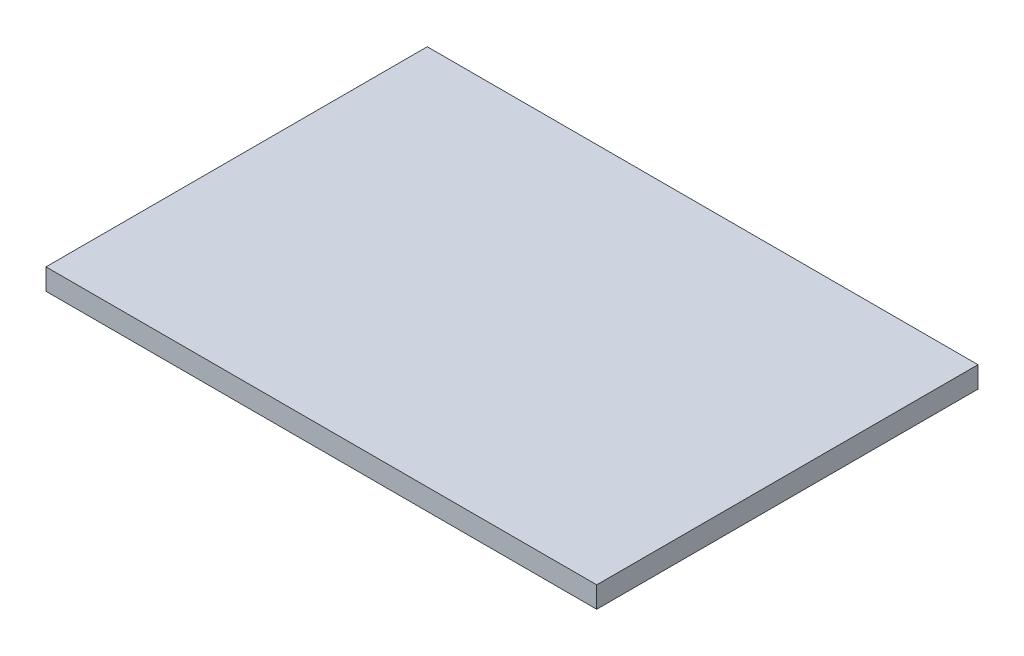
ISO-10303-21;
HEADER;
FILE_DESCRIPTION(('STEP AP214'),'2;1');
FILE_NAME('part.step','',(''),(''),'','','');
FILE_SCHEMA(('AUTOMOTIVE_DESIGN { 1 0 10303 214 1 1 1 1 }'));
ENDSEC;
DATA;
#1=APPLICATION_CONTEXT('core data for automotive mechanical design processes');
#2=APPLICATION_PROTOCOL_DEFINITION('international standard','automotive_design',2000,#1);
#3=PRODUCT_CONTEXT('',#1,'mechanical');
#4=PRODUCT('Part','Part','',(#3));
#5=PRODUCT_RELATED_PRODUCT_CATEGORY('part','',(#4));
#6=PRODUCT_DEFINITION_FORMATION('','',#4);
#7=PRODUCT_DEFINITION_CONTEXT('part definition',#1,'design');
#8=PRODUCT_DEFINITION('design','',#6,#7);
#9=PRODUCT_DEFINITION_SHAPE('','',#8);
#10=(LENGTH_UNIT() NAMED_UNIT(*) SI_UNIT(.MILLI.,.METRE.));
#11=(NAMED_UNIT(*) PLANE_ANGLE_UNIT() SI_UNIT($,.RADIAN.));
#12=(NAMED_UNIT(*) SI_UNIT($,.STERADIAN.) SOLID_ANGLE_UNIT());
#13=UNCERTAINTY_MEASURE_WITH_UNIT(LENGTH_MEASURE(1.E-05),#10,'distance_accuracy_value','');
#14=(GEOMETRIC_REPRESENTATION_CONTEXT(3) GLOBAL_UNCERTAINTY_ASSIGNED_CONTEXT((#13)) GLOBAL_UNIT_ASSIGNED_CONTEXT((#10,
#11,#12)) REPRESENTATION_CONTEXT('',''));
#15=CARTESIAN_POINT('',(0.,0.,0.));
#16=DIRECTION('',(0.,0.,1.));
#17=DIRECTION('',(1.,0.,0.));
#18=AXIS2_PLACEMENT_3D('',#15,#16,#17);
#19=CARTESIAN_POINT('',(13.,1.,9.));
#20=DIRECTION('',(-1.,0.,0.));
#21=DIRECTION('',(0.,0.,1.));
#22=AXIS2_PLACEMENT_3D('',#19,#20,#21);
#23=PLANE('',#22);
#24=DIRECTION('',(0.,0.,-1.));
#25=VECTOR('',#24,1.);
#26=CARTESIAN_POINT('',(13.,0.,9.));
#27=LINE('',#26,#25);
#28=CARTESIAN_POINT('',(13.,0.,9.));
#29=VERTEX_POINT('',#28);
#30=CARTESIAN_POINT('',(13.,0.,-9.));
#31=VERTEX_POINT('',#30);
#32=EDGE_CURVE('E107',#29,#31,#27,.T.);
#33=ORIENTED_EDGE('',*,*,#32,.T.);
#34=DIRECTION('',(0.,-1.,0.));
#35=VECTOR('',#34,1.);
#36=CARTESIAN_POINT('',(13.,1.,-9.));
#37=LINE('',#36,#35);
#38=CARTESIAN_POINT('',(13.,1.,-9.));
#39=VERTEX_POINT('',#38);
#40=EDGE_CURVE('E11',#39,#31,#37,.T.);
#41=ORIENTED_EDGE('',*,*,#40,.F.);
#42=DIRECTION('',(0.,0.,-1.));
#43=VECTOR('',#42,1.);
#44=CARTESIAN_POINT('',(13.,1.,9.));
#45=LINE('',#44,#43);
#46=CARTESIAN_POINT('',(13.,1.,9.));
#47=VERTEX_POINT('',#46);
#48=EDGE_CURVE('E91',#47,#39,#45,.T.);
#49=ORIENTED_EDGE('',*,*,#48,.F.);
#50=DIRECTION('',(0.,-1.,0.));
#51=VECTOR('',#50,1.);
#52=CARTESIAN_POINT('',(13.,1.,9.));
#53=LINE('',#52,#51);
#54=EDGE_CURVE('E103',#47,#29,#53,.T.);
#55=ORIENTED_EDGE('',*,*,#54,.T.);
#56=EDGE_LOOP('',(#33,#41,#49,#55));
#57=FACE_BOUND('',#56,.T.);
#58=ADVANCED_FACE('F39',(#57),#23,.F.);
#59=CARTESIAN_POINT('',(-13.,1.,-9.));
#60=DIRECTION('',(0.,0.,1.));
#61=DIRECTION('',(1.,0.,0.));
#62=AXIS2_PLACEMENT_3D('',#59,#60,#61);
#63=PLANE('',#62);
#64=DIRECTION('',(-1.,0.,0.));
#65=VECTOR('',#64,1.);
#66=CARTESIAN_POINT('',(-13.,0.,-9.));
#67=LINE('',#66,#65);
#68=CARTESIAN_POINT('',(-13.,0.,-9.));
#69=VERTEX_POINT('',#68);
#70=EDGE_CURVE('E96',#31,#69,#67,.T.);
#71=ORIENTED_EDGE('',*,*,#70,.T.);
#72=DIRECTION('',(0.,-1.,0.));
#73=VECTOR('',#72,1.);
#74=CARTESIAN_POINT('',(-13.,1.,-9.));
#75=LINE('',#74,#73);
#76=CARTESIAN_POINT('',(-13.,1.,-9.));
#77=VERTEX_POINT('',#76);
#78=EDGE_CURVE('E48',#77,#69,#75,.T.);
#79=ORIENTED_EDGE('',*,*,#78,.F.);
#80=DIRECTION('',(-1.,0.,0.));
#81=VECTOR('',#80,1.);
#82=CARTESIAN_POINT('',(-13.,1.,-9.));
#83=LINE('',#82,#81);
#84=EDGE_CURVE('E86',#39,#77,#83,.T.);
#85=ORIENTED_EDGE('',*,*,#84,.F.);
#86=ORIENTED_EDGE('',*,*,#40,.T.);
#87=EDGE_LOOP('',(#71,#79,#85,#86));
#88=FACE_BOUND('',#87,.T.);
#89=ADVANCED_FACE('F95',(#88),#63,.F.);
#90=CARTESIAN_POINT('',(-13.,1.,9.));
#91=DIRECTION('',(1.,0.,0.));
#92=DIRECTION('',(0.,0.,-1.));
#93=AXIS2_PLACEMENT_3D('',#90,#91,#92);
#94=PLANE('',#93);
#95=DIRECTION('',(0.,0.,1.));
#96=VECTOR('',#95,1.);
#97=CARTESIAN_POINT('',(-13.,0.,9.));
#98=LINE('',#97,#96);
#99=CARTESIAN_POINT('',(-13.,0.,9.));
#100=VERTEX_POINT('',#99);
#101=EDGE_CURVE('E73',#69,#100,#98,.T.);
#102=ORIENTED_EDGE('',*,*,#101,.T.);
#103=DIRECTION('',(0.,-1.,0.));
#104=VECTOR('',#103,1.);
#105=CARTESIAN_POINT('',(-13.,1.,9.));
#106=LINE('',#105,#104);
#107=CARTESIAN_POINT('',(-13.,1.,9.));
#108=VERTEX_POINT('',#107);
#109=EDGE_CURVE('E98',#108,#100,#106,.T.);
#110=ORIENTED_EDGE('',*,*,#109,.F.);
#111=DIRECTION('',(0.,0.,1.));
#112=VECTOR('',#111,1.);
#113=CARTESIAN_POINT('',(-13.,1.,9.));
#114=LINE('',#113,#112);
#115=EDGE_CURVE('E89',#77,#108,#114,.T.);
#116=ORIENTED_EDGE('',*,*,#115,.F.);
#117=ORIENTED_EDGE('',*,*,#78,.T.);
#118=EDGE_LOOP('',(#102,#110,#116,#117));
#119=FACE_BOUND('',#118,.T.);
#120=ADVANCED_FACE('F99',(#119),#94,.F.);
#121=CARTESIAN_POINT('',(-13.,1.,9.));
#122=DIRECTION('',(0.,0.,-1.));
#123=DIRECTION('',(-1.,0.,0.));
#124=AXIS2_PLACEMENT_3D('',#121,#122,#123);
#125=PLANE('',#124);
#126=DIRECTION('',(1.,0.,0.));
#127=VECTOR('',#126,1.);
#128=CARTESIAN_POINT('',(-13.,0.,9.));
#129=LINE('',#128,#127);
#130=EDGE_CURVE('E79',#100,#29,#129,.T.);
#131=ORIENTED_EDGE('',*,*,#130,.T.);
#132=ORIENTED_EDGE('',*,*,#54,.F.);
#133=DIRECTION('',(1.,0.,0.));
#134=VECTOR('',#133,1.);
#135=CARTESIAN_POINT('',(-13.,1.,9.));
#136=LINE('',#135,#134);
#137=EDGE_CURVE('E56',#108,#47,#136,.T.);
#138=ORIENTED_EDGE('',*,*,#137,.F.);
#139=ORIENTED_EDGE('',*,*,#109,.T.);
#140=EDGE_LOOP('',(#131,#132,#138,#139));
#141=FACE_BOUND('',#140,.T.);
#142=ADVANCED_FACE('F120',(#141),#125,.F.);
#143=CARTESIAN_POINT('',(0.,1.,0.));
#144=DIRECTION('',(0.,-1.,0.));
#145=DIRECTION('',(0.,0.,-1.));
#146=AXIS2_PLACEMENT_3D('',#143,#144,#145);
#147=PLANE('',#146);
#148=ORIENTED_EDGE('',*,*,#48,.T.);
#149=ORIENTED_EDGE('',*,*,#84,.T.);
#150=ORIENTED_EDGE('',*,*,#115,.T.);
#151=ORIENTED_EDGE('',*,*,#137,.T.);
#152=EDGE_LOOP('',(#148,#149,#150,#151));
#153=FACE_BOUND('',#152,.T.);
#154=ADVANCED_FACE('F87',(#153),#147,.F.);
#155=CARTESIAN_POINT('',(0.,0.,0.));
#156=DIRECTION('',(0.,-1.,0.));
#157=DIRECTION('',(0.,0.,-1.));
#158=AXIS2_PLACEMENT_3D('',#155,#156,#157);
#159=PLANE('',#158);
#160=ORIENTED_EDGE('',*,*,#32,.F.);
#161=ORIENTED_EDGE('',*,*,#130,.F.);
#162=ORIENTED_EDGE('',*,*,#101,.F.);
#163=ORIENTED_EDGE('',*,*,#70,.F.);
#164=EDGE_LOOP('',(#160,#161,#162,#163));
#165=FACE_BOUND('',#164,.T.);
#166=ADVANCED_FACE('F123',(#165),#159,.T.);
#167=CLOSED_SHELL('',(#58,#89,#120,#142,#154,#166));
#168=MANIFOLD_SOLID_BREP('B2',#167);
#169=ADVANCED_BREP_SHAPE_REPRESENTATION('',(#18,#168),#14);
#170=SHAPE_DEFINITION_REPRESENTATION(#9,#169);
ENDSEC;
END-ISO-10303-21;
